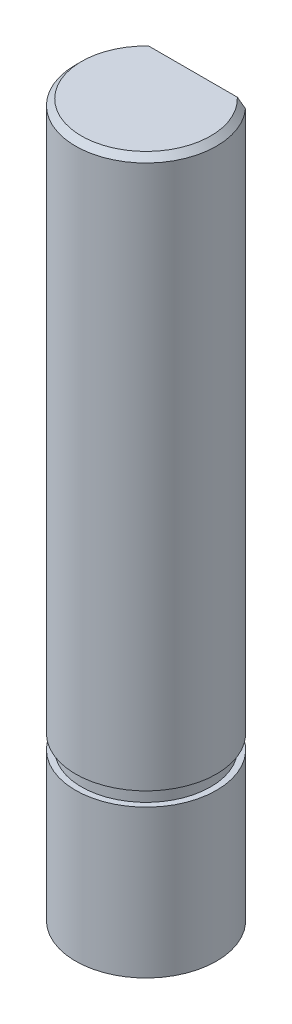
ISO-10303-21;
HEADER;
FILE_DESCRIPTION(('STEP AP214'),'2;1');
FILE_NAME('part.step','',(''),(''),'','','');
FILE_SCHEMA(('AUTOMOTIVE_DESIGN { 1 0 10303 214 1 1 1 1 }'));
ENDSEC;
DATA;
#1=APPLICATION_CONTEXT('core data for automotive mechanical design processes');
#2=APPLICATION_PROTOCOL_DEFINITION('international standard','automotive_design',2000,#1);
#3=PRODUCT_CONTEXT('',#1,'mechanical');
#4=PRODUCT('Part','Part','',(#3));
#5=PRODUCT_RELATED_PRODUCT_CATEGORY('part','',(#4));
#6=PRODUCT_DEFINITION_FORMATION('','',#4);
#7=PRODUCT_DEFINITION_CONTEXT('part definition',#1,'design');
#8=PRODUCT_DEFINITION('design','',#6,#7);
#9=PRODUCT_DEFINITION_SHAPE('','',#8);
#10=(LENGTH_UNIT() NAMED_UNIT(*) SI_UNIT(.MILLI.,.METRE.));
#11=(NAMED_UNIT(*) PLANE_ANGLE_UNIT() SI_UNIT($,.RADIAN.));
#12=(NAMED_UNIT(*) SI_UNIT($,.STERADIAN.) SOLID_ANGLE_UNIT());
#13=UNCERTAINTY_MEASURE_WITH_UNIT(LENGTH_MEASURE(1.E-05),#10,'distance_accuracy_value','');
#14=(GEOMETRIC_REPRESENTATION_CONTEXT(3) GLOBAL_UNCERTAINTY_ASSIGNED_CONTEXT((#13)) GLOBAL_UNIT_ASSIGNED_CONTEXT((#10,
#11,#12)) REPRESENTATION_CONTEXT('',''));
#15=CARTESIAN_POINT('',(0.,0.,0.));
#16=DIRECTION('',(0.,0.,1.));
#17=DIRECTION('',(1.,0.,0.));
#18=AXIS2_PLACEMENT_3D('',#15,#16,#17);
#19=CARTESIAN_POINT('',(0.,16.4,0.));
#20=DIRECTION('',(0.,1.,0.));
#21=DIRECTION('',(-1.,0.,0.));
#22=AXIS2_PLACEMENT_3D('',#19,#20,#21);
#23=CYLINDRICAL_SURFACE('',#22,3.);
#24=DIRECTION('',(0.,1.,0.));
#25=VECTOR('',#24,1.);
#26=CARTESIAN_POINT('',(2.23606797749979,16.4,-2.));
#27=LINE('',#26,#25);
#28=CARTESIAN_POINT('',(2.23606797749979,20.4,-2.));
#29=VERTEX_POINT('',#28);
#30=CARTESIAN_POINT('',(2.23606797749979,40.15,-2.));
#31=VERTEX_POINT('',#30);
#32=EDGE_CURVE('E93',#29,#31,#27,.T.);
#33=ORIENTED_EDGE('',*,*,#32,.T.);
#34=CARTESIAN_POINT('',(0.,40.15,0.));
#35=DIRECTION('',(0.,1.,0.));
#36=DIRECTION('',(-1.,0.,0.));
#37=AXIS2_PLACEMENT_3D('',#34,#35,#36);
#38=CIRCLE('',#37,3.);
#39=CARTESIAN_POINT('',(3.,40.15,0.));
#40=VERTEX_POINT('',#39);
#41=EDGE_CURVE('E26',#40,#31,#38,.T.);
#42=ORIENTED_EDGE('',*,*,#41,.F.);
#43=DIRECTION('',(0.,-1.,0.));
#44=VECTOR('',#43,1.);
#45=CARTESIAN_POINT('',(3.,16.4,0.));
#46=LINE('',#45,#44);
#47=CARTESIAN_POINT('',(3.,17.,0.));
#48=VERTEX_POINT('',#47);
#49=EDGE_CURVE('E10',#40,#48,#46,.T.);
#50=ORIENTED_EDGE('',*,*,#49,.T.);
#51=CARTESIAN_POINT('',(0.,17.,0.));
#52=DIRECTION('',(0.,1.,0.));
#53=DIRECTION('',(-1.,0.,0.));
#54=AXIS2_PLACEMENT_3D('',#51,#52,#53);
#55=CIRCLE('',#54,3.);
#56=EDGE_CURVE('E90',#48,#48,#55,.T.);
#57=ORIENTED_EDGE('',*,*,#56,.T.);
#58=ORIENTED_EDGE('',*,*,#49,.F.);
#59=CARTESIAN_POINT('',(0.,40.15,0.));
#60=DIRECTION('',(0.,1.,0.));
#61=DIRECTION('',(-1.,0.,0.));
#62=AXIS2_PLACEMENT_3D('',#59,#60,#61);
#63=CIRCLE('',#62,3.);
#64=CARTESIAN_POINT('',(-2.23606797749979,40.15,-2.));
#65=VERTEX_POINT('',#64);
#66=EDGE_CURVE('E100',#65,#40,#63,.T.);
#67=ORIENTED_EDGE('',*,*,#66,.F.);
#68=DIRECTION('',(0.,-1.,0.));
#69=VECTOR('',#68,1.);
#70=CARTESIAN_POINT('',(-2.23606797749979,16.4,-2.));
#71=LINE('',#70,#69);
#72=CARTESIAN_POINT('',(-2.23606797749979,20.4,-2.));
#73=VERTEX_POINT('',#72);
#74=EDGE_CURVE('E102',#65,#73,#71,.T.);
#75=ORIENTED_EDGE('',*,*,#74,.T.);
#76=CARTESIAN_POINT('',(0.,20.4,0.));
#77=DIRECTION('',(0.,-1.,0.));
#78=DIRECTION('',(-1.,0.,0.));
#79=AXIS2_PLACEMENT_3D('',#76,#77,#78);
#80=CIRCLE('',#79,3.);
#81=EDGE_CURVE('E101',#73,#29,#80,.T.);
#82=ORIENTED_EDGE('',*,*,#81,.T.);
#83=EDGE_LOOP('',(#33,#42,#50,#57,#58,#67,#75,#82));
#84=FACE_BOUND('',#83,.T.);
#85=ADVANCED_FACE('F15',(#84),#23,.T.);
#86=CARTESIAN_POINT('',(0.,40.275,0.));
#87=DIRECTION('',(0.,-1.,0.));
#88=DIRECTION('',(0.,0.,1.));
#89=AXIS2_PLACEMENT_3D('',#86,#87,#88);
#90=CONICAL_SURFACE('',#89,2.875,0.785398163397442);
#91=CARTESIAN_POINT('',(2.23606797749979,40.15,-2.));
#92=CARTESIAN_POINT('',(2.05418482862217,40.2855676949507,-2.));
#93=CARTESIAN_POINT('',(1.88745860881769,40.4,-2.));
#94=(BOUNDED_CURVE() B_SPLINE_CURVE(2,(#91,#92,#93),.UNSPECIFIED.,.F.,
.F.) B_SPLINE_CURVE_WITH_KNOTS((3,3),(0.,0.0429005754329433),
.UNSPECIFIED.) CURVE() GEOMETRIC_REPRESENTATION_ITEM() RATIONAL_B_SPLINE_CURVE((1.,
1.00184294215737,1.)) REPRESENTATION_ITEM(''));
#95=CARTESIAN_POINT('',(1.88745860881769,40.4,-2.));
#96=VERTEX_POINT('',#95);
#97=EDGE_CURVE('E87',#31,#96,#94,.T.);
#98=ORIENTED_EDGE('',*,*,#97,.T.);
#99=CARTESIAN_POINT('',(0.,40.4,0.));
#100=DIRECTION('',(0.,-1.,0.));
#101=DIRECTION('',(-1.,0.,0.));
#102=AXIS2_PLACEMENT_3D('',#99,#100,#101);
#103=CIRCLE('',#102,2.75);
#104=CARTESIAN_POINT('',(-1.88745860881769,40.4,-2.));
#105=VERTEX_POINT('',#104);
#106=EDGE_CURVE('E97',#96,#105,#103,.T.);
#107=ORIENTED_EDGE('',*,*,#106,.T.);
#108=CARTESIAN_POINT('',(-1.88745860881769,40.4,-2.));
#109=CARTESIAN_POINT('',(-2.05418482862217,40.2855676949507,-2.));
#110=CARTESIAN_POINT('',(-2.23606797749979,40.15,-2.));
#111=(BOUNDED_CURVE() B_SPLINE_CURVE(2,(#108,#109,#110),.UNSPECIFIED.,.F.,
.F.) B_SPLINE_CURVE_WITH_KNOTS((3,3),(0.,0.0429005754329433),
.UNSPECIFIED.) CURVE() GEOMETRIC_REPRESENTATION_ITEM() RATIONAL_B_SPLINE_CURVE((1.,
1.00184294215737,1.)) REPRESENTATION_ITEM(''));
#112=EDGE_CURVE('E106',#105,#65,#111,.T.);
#113=ORIENTED_EDGE('',*,*,#112,.T.);
#114=ORIENTED_EDGE('',*,*,#66,.T.);
#115=ORIENTED_EDGE('',*,*,#41,.T.);
#116=EDGE_LOOP('',(#98,#107,#113,#114,#115));
#117=FACE_BOUND('',#116,.T.);
#118=ADVANCED_FACE('F167',(#117),#90,.T.);
#119=CARTESIAN_POINT('',(0.,40.4,0.));
#120=DIRECTION('',(0.,1.,0.));
#121=DIRECTION('',(1.,0.,0.));
#122=AXIS2_PLACEMENT_3D('',#119,#120,#121);
#123=PLANE('',#122);
#124=DIRECTION('',(-1.,0.,0.));
#125=VECTOR('',#124,1.);
#126=CARTESIAN_POINT('',(1.11803398874989,40.4,-2.));
#127=LINE('',#126,#125);
#128=EDGE_CURVE('E111',#96,#105,#127,.T.);
#129=ORIENTED_EDGE('',*,*,#128,.T.);
#130=ORIENTED_EDGE('',*,*,#106,.F.);
#131=EDGE_LOOP('',(#129,#130));
#132=FACE_BOUND('',#131,.T.);
#133=ADVANCED_FACE('F172',(#132),#123,.T.);
#134=CARTESIAN_POINT('',(0.,20.4,-2.5));
#135=DIRECTION('',(0.,1.,0.));
#136=DIRECTION('',(1.,0.,0.));
#137=AXIS2_PLACEMENT_3D('',#134,#135,#136);
#138=PLANE('',#137);
#139=ORIENTED_EDGE('',*,*,#81,.F.);
#140=DIRECTION('',(-1.,0.,0.));
#141=VECTOR('',#140,1.);
#142=CARTESIAN_POINT('',(1.11803398874989,20.4,-2.));
#143=LINE('',#142,#141);
#144=EDGE_CURVE('E96',#29,#73,#143,.T.);
#145=ORIENTED_EDGE('',*,*,#144,.F.);
#146=EDGE_LOOP('',(#139,#145));
#147=FACE_BOUND('',#146,.T.);
#148=ADVANCED_FACE('F177',(#147),#138,.T.);
#149=CARTESIAN_POINT('',(2.23606797749979,40.4,-2.));
#150=DIRECTION('',(0.,0.,1.));
#151=DIRECTION('',(1.,0.,0.));
#152=AXIS2_PLACEMENT_3D('',#149,#150,#151);
#153=PLANE('',#152);
#154=ORIENTED_EDGE('',*,*,#97,.F.);
#155=ORIENTED_EDGE('',*,*,#32,.F.);
#156=ORIENTED_EDGE('',*,*,#144,.T.);
#157=ORIENTED_EDGE('',*,*,#74,.F.);
#158=ORIENTED_EDGE('',*,*,#112,.F.);
#159=ORIENTED_EDGE('',*,*,#128,.F.);
#160=EDGE_LOOP('',(#154,#155,#156,#157,#158,#159));
#161=FACE_BOUND('',#160,.T.);
#162=ADVANCED_FACE('F180',(#161),#153,.F.);
#163=CARTESIAN_POINT('',(0.,10.1,0.));
#164=DIRECTION('',(0.,1.,0.));
#165=DIRECTION('',(1.,0.,0.));
#166=AXIS2_PLACEMENT_3D('',#163,#164,#165);
#167=PLANE('',#166);
#168=CARTESIAN_POINT('',(0.,10.1,0.));
#169=DIRECTION('',(0.,-1.,0.));
#170=DIRECTION('',(-1.,0.,0.));
#171=AXIS2_PLACEMENT_3D('',#168,#169,#170);
#172=CIRCLE('',#171,3.);
#173=CARTESIAN_POINT('',(3.,10.1,0.));
#174=VERTEX_POINT('',#173);
#175=EDGE_CURVE('E80',#174,#174,#172,.T.);
#176=ORIENTED_EDGE('',*,*,#175,.T.);
#177=EDGE_LOOP('',(#176));
#178=FACE_BOUND('',#177,.T.);
#179=ADVANCED_FACE('F178',(#178),#167,.F.);
#180=CARTESIAN_POINT('',(0.,16.4,0.));
#181=DIRECTION('',(0.,1.,0.));
#182=DIRECTION('',(-1.,0.,0.));
#183=AXIS2_PLACEMENT_3D('',#180,#181,#182);
#184=CYLINDRICAL_SURFACE('',#183,3.);
#185=CARTESIAN_POINT('',(0.,16.4,0.));
#186=DIRECTION('',(0.,-1.,0.));
#187=DIRECTION('',(-1.,0.,0.));
#188=AXIS2_PLACEMENT_3D('',#185,#186,#187);
#189=CIRCLE('',#188,3.);
#190=CARTESIAN_POINT('',(3.,16.4,0.));
#191=VERTEX_POINT('',#190);
#192=EDGE_CURVE('E19',#191,#191,#189,.T.);
#193=ORIENTED_EDGE('',*,*,#192,.T.);
#194=DIRECTION('',(0.,-1.,0.));
#195=VECTOR('',#194,1.);
#196=CARTESIAN_POINT('',(3.,16.4,0.));
#197=LINE('',#196,#195);
#198=EDGE_CURVE('E77',#191,#174,#197,.T.);
#199=ORIENTED_EDGE('',*,*,#198,.T.);
#200=ORIENTED_EDGE('',*,*,#175,.F.);
#201=ORIENTED_EDGE('',*,*,#198,.F.);
#202=EDGE_LOOP('',(#193,#199,#200,#201));
#203=FACE_BOUND('',#202,.T.);
#204=ADVANCED_FACE('F78',(#203),#184,.T.);
#205=CARTESIAN_POINT('',(0.,16.4,0.));
#206=DIRECTION('',(0.,1.,0.));
#207=DIRECTION('',(1.,0.,0.));
#208=AXIS2_PLACEMENT_3D('',#205,#206,#207);
#209=PLANE('',#208);
#210=CARTESIAN_POINT('',(0.,16.4,0.));
#211=DIRECTION('',(0.,1.,0.));
#212=DIRECTION('',(-1.,0.,0.));
#213=AXIS2_PLACEMENT_3D('',#210,#211,#212);
#214=CIRCLE('',#213,2.75);
#215=CARTESIAN_POINT('',(2.75,16.4,0.));
#216=VERTEX_POINT('',#215);
#217=EDGE_CURVE('E127',#216,#216,#214,.T.);
#218=ORIENTED_EDGE('',*,*,#217,.F.);
#219=EDGE_LOOP('',(#218));
#220=FACE_BOUND('',#219,.T.);
#221=ORIENTED_EDGE('',*,*,#192,.F.);
#222=EDGE_LOOP('',(#221));
#223=FACE_BOUND('',#222,.T.);
#224=ADVANCED_FACE('F156',(#220,#223),#209,.T.);
#225=CARTESIAN_POINT('',(0.,17.,0.));
#226=DIRECTION('',(0.,1.,0.));
#227=DIRECTION('',(1.,0.,0.));
#228=AXIS2_PLACEMENT_3D('',#225,#226,#227);
#229=PLANE('',#228);
#230=CARTESIAN_POINT('',(0.,17.,0.));
#231=DIRECTION('',(0.,-1.,0.));
#232=DIRECTION('',(-1.,0.,0.));
#233=AXIS2_PLACEMENT_3D('',#230,#231,#232);
#234=CIRCLE('',#233,2.75);
#235=CARTESIAN_POINT('',(2.75,17.,0.));
#236=VERTEX_POINT('',#235);
#237=EDGE_CURVE('E126',#236,#236,#234,.T.);
#238=ORIENTED_EDGE('',*,*,#237,.F.);
#239=EDGE_LOOP('',(#238));
#240=FACE_BOUND('',#239,.T.);
#241=ORIENTED_EDGE('',*,*,#56,.F.);
#242=EDGE_LOOP('',(#241));
#243=FACE_BOUND('',#242,.T.);
#244=ADVANCED_FACE('F17',(#240,#243),#229,.F.);
#245=CARTESIAN_POINT('',(0.,16.4,0.));
#246=DIRECTION('',(0.,1.,0.));
#247=DIRECTION('',(-1.,0.,0.));
#248=AXIS2_PLACEMENT_3D('',#245,#246,#247);
#249=CYLINDRICAL_SURFACE('',#248,2.75);
#250=ORIENTED_EDGE('',*,*,#217,.T.);
#251=DIRECTION('',(0.,1.,0.));
#252=VECTOR('',#251,1.);
#253=CARTESIAN_POINT('',(2.75,16.4,0.));
#254=LINE('',#253,#252);
#255=EDGE_CURVE('E122',#216,#236,#254,.T.);
#256=ORIENTED_EDGE('',*,*,#255,.T.);
#257=ORIENTED_EDGE('',*,*,#237,.T.);
#258=ORIENTED_EDGE('',*,*,#255,.F.);
#259=EDGE_LOOP('',(#250,#256,#257,#258));
#260=FACE_BOUND('',#259,.T.);
#261=ADVANCED_FACE('F155',(#260),#249,.T.);
#262=CLOSED_SHELL('',(#85,#118,#133,#148,#162,#179,#204,#224,#244,#261));
#263=MANIFOLD_SOLID_BREP('B1',#262);
#264=ADVANCED_BREP_SHAPE_REPRESENTATION('',(#18,#263),#14);
#265=SHAPE_DEFINITION_REPRESENTATION(#9,#264);
ENDSEC;
END-ISO-10303-21;
